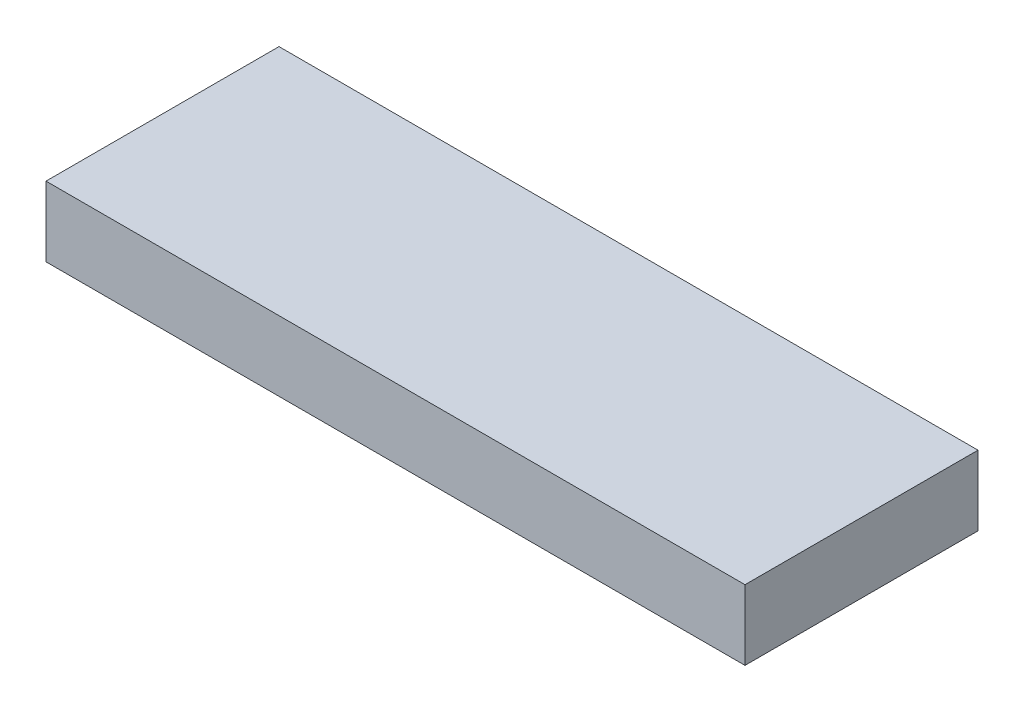
ISO-10303-21;
HEADER;
FILE_DESCRIPTION(('STEP AP214'),'2;1');
FILE_NAME('part.step','',(''),(''),'','','');
FILE_SCHEMA(('AUTOMOTIVE_DESIGN { 1 0 10303 214 1 1 1 1 }'));
ENDSEC;
DATA;
#1=APPLICATION_CONTEXT('core data for automotive mechanical design processes');
#2=APPLICATION_PROTOCOL_DEFINITION('international standard','automotive_design',2000,#1);
#3=PRODUCT_CONTEXT('',#1,'mechanical');
#4=PRODUCT('Part','Part','',(#3));
#5=PRODUCT_RELATED_PRODUCT_CATEGORY('part','',(#4));
#6=PRODUCT_DEFINITION_FORMATION('','',#4);
#7=PRODUCT_DEFINITION_CONTEXT('part definition',#1,'design');
#8=PRODUCT_DEFINITION('design','',#6,#7);
#9=PRODUCT_DEFINITION_SHAPE('','',#8);
#10=(LENGTH_UNIT() NAMED_UNIT(*) SI_UNIT(.MILLI.,.METRE.));
#11=(NAMED_UNIT(*) PLANE_ANGLE_UNIT() SI_UNIT($,.RADIAN.));
#12=(NAMED_UNIT(*) SI_UNIT($,.STERADIAN.) SOLID_ANGLE_UNIT());
#13=UNCERTAINTY_MEASURE_WITH_UNIT(LENGTH_MEASURE(1.E-05),#10,'distance_accuracy_value','');
#14=(GEOMETRIC_REPRESENTATION_CONTEXT(3) GLOBAL_UNCERTAINTY_ASSIGNED_CONTEXT((#13)) GLOBAL_UNIT_ASSIGNED_CONTEXT((#10,
#11,#12)) REPRESENTATION_CONTEXT('',''));
#15=CARTESIAN_POINT('',(0.,0.,0.));
#16=DIRECTION('',(0.,0.,1.));
#17=DIRECTION('',(1.,0.,0.));
#18=AXIS2_PLACEMENT_3D('',#15,#16,#17);
#19=CARTESIAN_POINT('',(-300.,46.99,50.));
#20=DIRECTION('',(0.,0.,1.));
#21=DIRECTION('',(1.,0.,0.));
#22=AXIS2_PLACEMENT_3D('',#19,#20,#21);
#23=PLANE('',#22);
#24=DIRECTION('',(0.,1.,0.));
#25=VECTOR('',#24,1.);
#26=CARTESIAN_POINT('',(-300.,0.,50.));
#27=LINE('',#26,#25);
#28=CARTESIAN_POINT('',(-300.,47.,50.));
#29=VERTEX_POINT('',#28);
#30=CARTESIAN_POINT('',(-300.,50.,50.));
#31=VERTEX_POINT('',#30);
#32=EDGE_CURVE('E85',#29,#31,#27,.T.);
#33=ORIENTED_EDGE('',*,*,#32,.F.);
#34=DIRECTION('',(1.,0.,0.));
#35=VECTOR('',#34,1.);
#36=CARTESIAN_POINT('',(300.,47.,50.));
#37=LINE('',#36,#35);
#38=CARTESIAN_POINT('',(-270.,47.,50.));
#39=VERTEX_POINT('',#38);
#40=EDGE_CURVE('E95',#29,#39,#37,.T.);
#41=ORIENTED_EDGE('',*,*,#40,.T.);
#42=DIRECTION('',(0.,1.,0.));
#43=VECTOR('',#42,1.);
#44=CARTESIAN_POINT('',(-270.,46.99,50.));
#45=LINE('',#44,#43);
#46=CARTESIAN_POINT('',(-270.,50.,50.));
#47=VERTEX_POINT('',#46);
#48=EDGE_CURVE('E51',#39,#47,#45,.T.);
#49=ORIENTED_EDGE('',*,*,#48,.T.);
#50=DIRECTION('',(-1.,0.,0.));
#51=VECTOR('',#50,1.);
#52=CARTESIAN_POINT('',(-300.,50.,50.));
#53=LINE('',#52,#51);
#54=EDGE_CURVE('E90',#47,#31,#53,.T.);
#55=ORIENTED_EDGE('',*,*,#54,.T.);
#56=EDGE_LOOP('',(#33,#41,#49,#55));
#57=FACE_BOUND('',#56,.T.);
#58=ADVANCED_FACE('F35',(#57),#23,.T.);
#59=CARTESIAN_POINT('',(-300.,46.99,40.));
#60=DIRECTION('',(0.,0.,-1.));
#61=DIRECTION('',(-1.,0.,0.));
#62=AXIS2_PLACEMENT_3D('',#59,#60,#61);
#63=PLANE('',#62);
#64=DIRECTION('',(0.,1.,0.));
#65=VECTOR('',#64,1.);
#66=CARTESIAN_POINT('',(-270.,46.99,40.));
#67=LINE('',#66,#65);
#68=CARTESIAN_POINT('',(-270.,47.,40.));
#69=VERTEX_POINT('',#68);
#70=CARTESIAN_POINT('',(-270.,50.,40.));
#71=VERTEX_POINT('',#70);
#72=EDGE_CURVE('E58',#69,#71,#67,.T.);
#73=ORIENTED_EDGE('',*,*,#72,.F.);
#74=DIRECTION('',(-1.,0.,0.));
#75=VECTOR('',#74,1.);
#76=CARTESIAN_POINT('',(300.,47.,40.));
#77=LINE('',#76,#75);
#78=CARTESIAN_POINT('',(-300.,47.,40.));
#79=VERTEX_POINT('',#78);
#80=EDGE_CURVE('E87',#69,#79,#77,.T.);
#81=ORIENTED_EDGE('',*,*,#80,.T.);
#82=DIRECTION('',(0.,-1.,0.));
#83=VECTOR('',#82,1.);
#84=CARTESIAN_POINT('',(-300.,0.,40.));
#85=LINE('',#84,#83);
#86=CARTESIAN_POINT('',(-300.,50.,40.));
#87=VERTEX_POINT('',#86);
#88=EDGE_CURVE('E78',#87,#79,#85,.T.);
#89=ORIENTED_EDGE('',*,*,#88,.F.);
#90=DIRECTION('',(1.,0.,0.));
#91=VECTOR('',#90,1.);
#92=CARTESIAN_POINT('',(-300.,50.,40.));
#93=LINE('',#92,#91);
#94=EDGE_CURVE('E11',#87,#71,#93,.T.);
#95=ORIENTED_EDGE('',*,*,#94,.T.);
#96=EDGE_LOOP('',(#73,#81,#89,#95));
#97=FACE_BOUND('',#96,.T.);
#98=ADVANCED_FACE('F88',(#97),#63,.T.);
#99=CARTESIAN_POINT('',(-270.,46.99,40.));
#100=DIRECTION('',(1.,0.,0.));
#101=DIRECTION('',(0.,0.,-1.));
#102=AXIS2_PLACEMENT_3D('',#99,#100,#101);
#103=PLANE('',#102);
#104=ORIENTED_EDGE('',*,*,#48,.F.);
#105=DIRECTION('',(0.,0.,-1.));
#106=VECTOR('',#105,1.);
#107=CARTESIAN_POINT('',(-270.,47.,3.));
#108=LINE('',#107,#106);
#109=EDGE_CURVE('E38',#39,#69,#108,.T.);
#110=ORIENTED_EDGE('',*,*,#109,.T.);
#111=ORIENTED_EDGE('',*,*,#72,.T.);
#112=DIRECTION('',(0.,0.,1.));
#113=VECTOR('',#112,1.);
#114=CARTESIAN_POINT('',(-270.,50.,60.));
#115=LINE('',#114,#113);
#116=EDGE_CURVE('E43',#71,#47,#115,.T.);
#117=ORIENTED_EDGE('',*,*,#116,.T.);
#118=EDGE_LOOP('',(#104,#110,#111,#117));
#119=FACE_BOUND('',#118,.T.);
#120=ADVANCED_FACE('F105',(#119),#103,.T.);
#121=CARTESIAN_POINT('',(-300.,0.,0.));
#122=DIRECTION('',(-1.,0.,0.));
#123=DIRECTION('',(0.,0.,1.));
#124=AXIS2_PLACEMENT_3D('',#121,#122,#123);
#125=PLANE('',#124);
#126=DIRECTION('',(0.,0.,1.));
#127=VECTOR('',#126,1.);
#128=CARTESIAN_POINT('',(-300.,47.,3.));
#129=LINE('',#128,#127);
#130=EDGE_CURVE('E81',#79,#29,#129,.T.);
#131=ORIENTED_EDGE('',*,*,#130,.T.);
#132=ORIENTED_EDGE('',*,*,#32,.T.);
#133=DIRECTION('',(0.,0.,-1.));
#134=VECTOR('',#133,1.);
#135=CARTESIAN_POINT('',(-300.,50.,60.));
#136=LINE('',#135,#134);
#137=EDGE_CURVE('E83',#31,#87,#136,.T.);
#138=ORIENTED_EDGE('',*,*,#137,.T.);
#139=ORIENTED_EDGE('',*,*,#88,.T.);
#140=EDGE_LOOP('',(#131,#132,#138,#139));
#141=FACE_BOUND('',#140,.T.);
#142=ADVANCED_FACE('F79',(#141),#125,.T.);
#143=CARTESIAN_POINT('',(-300.,50.,60.));
#144=DIRECTION('',(0.,-1.,0.));
#145=DIRECTION('',(0.,0.,-1.));
#146=AXIS2_PLACEMENT_3D('',#143,#144,#145);
#147=PLANE('',#146);
#148=ORIENTED_EDGE('',*,*,#54,.F.);
#149=ORIENTED_EDGE('',*,*,#116,.F.);
#150=ORIENTED_EDGE('',*,*,#94,.F.);
#151=ORIENTED_EDGE('',*,*,#137,.F.);
#152=EDGE_LOOP('',(#148,#149,#150,#151));
#153=FACE_BOUND('',#152,.T.);
#154=ADVANCED_FACE('F109',(#153),#147,.F.);
#155=CARTESIAN_POINT('',(300.,47.,3.));
#156=DIRECTION('',(0.,1.,0.));
#157=DIRECTION('',(0.,0.,1.));
#158=AXIS2_PLACEMENT_3D('',#155,#156,#157);
#159=PLANE('',#158);
#160=ORIENTED_EDGE('',*,*,#40,.F.);
#161=ORIENTED_EDGE('',*,*,#130,.F.);
#162=ORIENTED_EDGE('',*,*,#80,.F.);
#163=ORIENTED_EDGE('',*,*,#109,.F.);
#164=EDGE_LOOP('',(#160,#161,#162,#163));
#165=FACE_BOUND('',#164,.T.);
#166=ADVANCED_FACE('F93',(#165),#159,.F.);
#167=CLOSED_SHELL('',(#58,#98,#120,#142,#154,#166));
#168=MANIFOLD_SOLID_BREP('B2',#167);
#169=ADVANCED_BREP_SHAPE_REPRESENTATION('',(#18,#168),#14);
#170=SHAPE_DEFINITION_REPRESENTATION(#9,#169);
ENDSEC;
END-ISO-10303-21;
